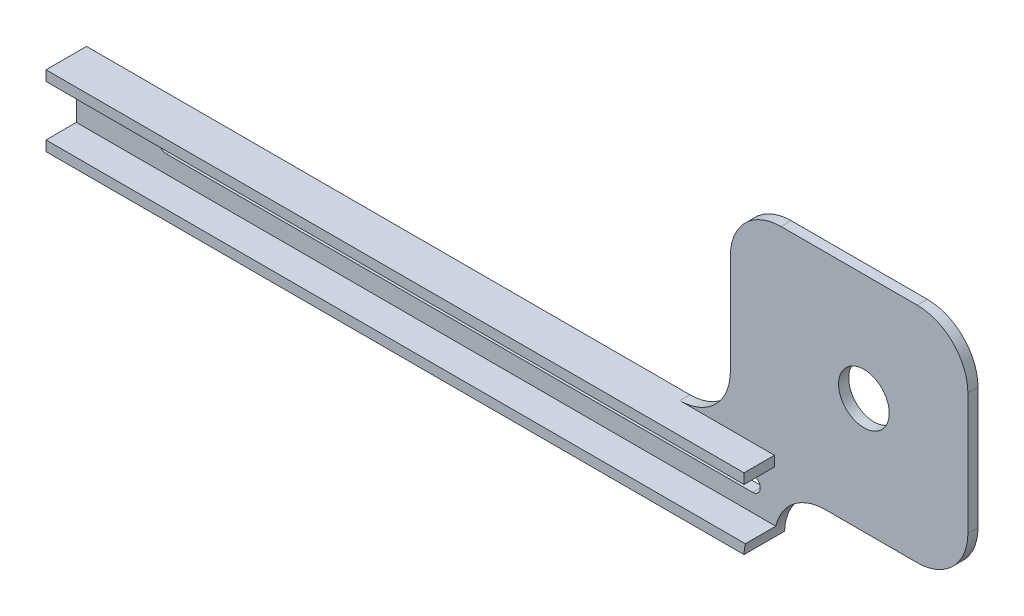
ISO-10303-21;
HEADER;
FILE_DESCRIPTION(('STEP AP214'),'2;1');
FILE_NAME('part.step','',(''),(''),'','','');
FILE_SCHEMA(('AUTOMOTIVE_DESIGN { 1 0 10303 214 1 1 1 1 }'));
ENDSEC;
DATA;
#1=APPLICATION_CONTEXT('core data for automotive mechanical design processes');
#2=APPLICATION_PROTOCOL_DEFINITION('international standard','automotive_design',2000,#1);
#3=PRODUCT_CONTEXT('',#1,'mechanical');
#4=PRODUCT('Part','Part','',(#3));
#5=PRODUCT_RELATED_PRODUCT_CATEGORY('part','',(#4));
#6=PRODUCT_DEFINITION_FORMATION('','',#4);
#7=PRODUCT_DEFINITION_CONTEXT('part definition',#1,'design');
#8=PRODUCT_DEFINITION('design','',#6,#7);
#9=PRODUCT_DEFINITION_SHAPE('','',#8);
#10=(LENGTH_UNIT() NAMED_UNIT(*) SI_UNIT(.MILLI.,.METRE.));
#11=(NAMED_UNIT(*) PLANE_ANGLE_UNIT() SI_UNIT($,.RADIAN.));
#12=(NAMED_UNIT(*) SI_UNIT($,.STERADIAN.) SOLID_ANGLE_UNIT());
#13=UNCERTAINTY_MEASURE_WITH_UNIT(LENGTH_MEASURE(1.E-05),#10,'distance_accuracy_value','');
#14=(GEOMETRIC_REPRESENTATION_CONTEXT(3) GLOBAL_UNCERTAINTY_ASSIGNED_CONTEXT((#13)) GLOBAL_UNIT_ASSIGNED_CONTEXT((#10,
#11,#12)) REPRESENTATION_CONTEXT('',''));
#15=CARTESIAN_POINT('',(0.,0.,0.));
#16=DIRECTION('',(0.,0.,1.));
#17=DIRECTION('',(1.,0.,0.));
#18=AXIS2_PLACEMENT_3D('',#15,#16,#17);
#19=CARTESIAN_POINT('',(0.,0.,-12.4577761138942));
#20=DIRECTION('',(0.,0.,1.));
#21=DIRECTION('',(1.,0.,0.));
#22=AXIS2_PLACEMENT_3D('',#19,#20,#21);
#23=PLANE('',#22);
#24=DIRECTION('',(1.,0.,0.));
#25=VECTOR('',#24,1.);
#26=CARTESIAN_POINT('',(0.,21.8576281221092,-12.4577761138942));
#27=LINE('',#26,#25);
#28=CARTESIAN_POINT('',(12.6949971843607,21.8576281221092,-12.4577761138942));
#29=VERTEX_POINT('',#28);
#30=CARTESIAN_POINT('',(35.8128892215013,21.8576281221092,-12.4577761138942));
#31=VERTEX_POINT('',#30);
#32=EDGE_CURVE('E216',#29,#31,#27,.T.);
#33=ORIENTED_EDGE('',*,*,#32,.T.);
#34=CARTESIAN_POINT('',(35.8128892215013,34.5576281221092,-12.4577761138942));
#35=DIRECTION('',(0.,0.,1.));
#36=DIRECTION('',(1.,0.,0.));
#37=AXIS2_PLACEMENT_3D('',#34,#35,#36);
#38=CIRCLE('',#37,12.7);
#39=CARTESIAN_POINT('',(48.5128892215013,34.5576281221092,-12.4577761138942));
#40=VERTEX_POINT('',#39);
#41=EDGE_CURVE('E258',#31,#40,#38,.T.);
#42=ORIENTED_EDGE('',*,*,#41,.T.);
#43=DIRECTION('',(0.,-1.,0.));
#44=VECTOR('',#43,1.);
#45=CARTESIAN_POINT('',(48.5128892215013,92.1462730990898,-12.4577761138942));
#46=LINE('',#45,#44);
#47=CARTESIAN_POINT('',(48.5128892215013,65.1027477203647,-12.4577761138942));
#48=VERTEX_POINT('',#47);
#49=EDGE_CURVE('E298',#48,#40,#46,.T.);
#50=ORIENTED_EDGE('',*,*,#49,.F.);
#51=CARTESIAN_POINT('',(35.8128892215013,65.1027477203647,-12.4577761138942));
#52=DIRECTION('',(0.,0.,1.));
#53=DIRECTION('',(1.,0.,0.));
#54=AXIS2_PLACEMENT_3D('',#51,#52,#53);
#55=CIRCLE('',#54,12.7);
#56=CARTESIAN_POINT('',(35.8128892215012,77.8027477203647,-12.4577761138942));
#57=VERTEX_POINT('',#56);
#58=EDGE_CURVE('E256',#48,#57,#55,.T.);
#59=ORIENTED_EDGE('',*,*,#58,.T.);
#60=DIRECTION('',(-1.,0.,0.));
#61=VECTOR('',#60,1.);
#62=CARTESIAN_POINT('',(-175.067056308692,77.8027477203647,-12.4577761138942));
#63=LINE('',#62,#61);
#64=CARTESIAN_POINT('',(1.64991922651991,77.8027477203647,-12.4577761138942));
#65=VERTEX_POINT('',#64);
#66=EDGE_CURVE('E210',#57,#65,#63,.T.);
#67=ORIENTED_EDGE('',*,*,#66,.T.);
#68=CARTESIAN_POINT('',(1.64991922651998,65.1027477203647,-12.4577761138942));
#69=DIRECTION('',(0.,0.,1.));
#70=DIRECTION('',(1.,0.,0.));
#71=AXIS2_PLACEMENT_3D('',#68,#69,#70);
#72=CIRCLE('',#71,12.7);
#73=CARTESIAN_POINT('',(-11.05008077348,65.1027477203647,-12.4577761138942));
#74=VERTEX_POINT('',#73);
#75=EDGE_CURVE('E254',#65,#74,#72,.T.);
#76=ORIENTED_EDGE('',*,*,#75,.T.);
#77=DIRECTION('',(0.,1.,0.));
#78=VECTOR('',#77,1.);
#79=CARTESIAN_POINT('',(-11.05008077348,27.2940639355094,-12.4577761138942));
#80=LINE('',#79,#78);
#81=CARTESIAN_POINT('',(-11.05008077348,39.9940639355094,-12.4577761138942));
#82=VERTEX_POINT('',#81);
#83=EDGE_CURVE('E202',#82,#74,#80,.T.);
#84=ORIENTED_EDGE('',*,*,#83,.F.);
#85=CARTESIAN_POINT('',(-23.75008077348,39.9940639355094,-12.4577761138942));
#86=DIRECTION('',(0.,0.,1.));
#87=DIRECTION('',(1.,0.,0.));
#88=AXIS2_PLACEMENT_3D('',#85,#86,#87);
#89=CIRCLE('',#88,12.7);
#90=CARTESIAN_POINT('',(-23.75008077348,27.2940639355094,-12.4577761138942));
#91=VERTEX_POINT('',#90);
#92=EDGE_CURVE('E264',#82,#91,#89,.F.);
#93=ORIENTED_EDGE('',*,*,#92,.T.);
#94=DIRECTION('',(-1.,0.,0.));
#95=VECTOR('',#94,1.);
#96=CARTESIAN_POINT('',(-175.067056308692,27.2940639355094,-12.4577761138942));
#97=LINE('',#96,#95);
#98=CARTESIAN_POINT('',(0.,27.2940639355094,-12.4577761138942));
#99=VERTEX_POINT('',#98);
#100=EDGE_CURVE('E314',#99,#91,#97,.T.);
#101=ORIENTED_EDGE('',*,*,#100,.F.);
#102=DIRECTION('',(0.,1.,0.));
#103=VECTOR('',#102,1.);
#104=CARTESIAN_POINT('',(0.,24.7540639355094,-12.4577761138942));
#105=LINE('',#104,#103);
#106=CARTESIAN_POINT('',(0.,24.7540639355094,-12.4577761138942));
#107=VERTEX_POINT('',#106);
#108=EDGE_CURVE('E321',#107,#99,#105,.T.);
#109=ORIENTED_EDGE('',*,*,#108,.F.);
#110=DIRECTION('',(1.,0.,0.));
#111=VECTOR('',#110,1.);
#112=CARTESIAN_POINT('',(-175.067056308692,24.7540639355094,-12.4577761138942));
#113=LINE('',#112,#111);
#114=CARTESIAN_POINT('',(-175.067056308692,24.7540639355094,-12.4577761138942));
#115=VERTEX_POINT('',#114);
#116=EDGE_CURVE('E311',#115,#107,#113,.T.);
#117=ORIENTED_EDGE('',*,*,#116,.F.);
#118=DIRECTION('',(0.,-1.,0.));
#119=VECTOR('',#118,1.);
#120=CARTESIAN_POINT('',(-175.067056308692,77.8027477203647,-12.4577761138942));
#121=LINE('',#120,#119);
#122=CARTESIAN_POINT('',(-175.067056308692,12.0540639355095,-12.4577761138942));
#123=VERTEX_POINT('',#122);
#124=EDGE_CURVE('E225',#115,#123,#121,.T.);
#125=ORIENTED_EDGE('',*,*,#124,.T.);
#126=DIRECTION('',(-1.,0.,0.));
#127=VECTOR('',#126,1.);
#128=CARTESIAN_POINT('',(-175.067056308692,12.0540639355095,-12.4577761138942));
#129=LINE('',#128,#127);
#130=CARTESIAN_POINT('',(0.329696558057507,12.0540639355094,-12.4577761138942));
#131=VERTEX_POINT('',#130);
#132=EDGE_CURVE('E52',#131,#123,#129,.T.);
#133=ORIENTED_EDGE('',*,*,#132,.F.);
#134=CARTESIAN_POINT('',(12.6949971843607,9.15762812210916,-12.4577761138942));
#135=DIRECTION('',(0.,0.,1.));
#136=DIRECTION('',(1.,0.,0.));
#137=AXIS2_PLACEMENT_3D('',#134,#135,#136);
#138=CIRCLE('',#137,12.7);
#139=EDGE_CURVE('E45',#131,#29,#138,.F.);
#140=ORIENTED_EDGE('',*,*,#139,.T.);
#141=EDGE_LOOP('',(#33,#42,#50,#59,#67,#76,#84,#93,#101,#109,#117,#125,#133,#140));
#142=FACE_BOUND('',#141,.T.);
#143=CARTESIAN_POINT('',(22.4397960445111,50.8255354857187,-12.4577761138942));
#144=DIRECTION('',(0.,0.,1.));
#145=DIRECTION('',(1.,0.,0.));
#146=AXIS2_PLACEMENT_3D('',#143,#144,#145);
#147=CIRCLE('',#146,6.35);
#148=CARTESIAN_POINT('',(28.7897960445111,50.8255354857187,-12.4577761138942));
#149=VERTEX_POINT('',#148);
#150=EDGE_CURVE('E333',#149,#149,#147,.T.);
#151=ORIENTED_EDGE('',*,*,#150,.F.);
#152=EDGE_LOOP('',(#151));
#153=FACE_BOUND('',#152,.T.);
#154=CARTESIAN_POINT('',(-152.479240822598,18.4040639355094,-12.4577761138942));
#155=DIRECTION('',(0.,0.,1.));
#156=DIRECTION('',(1.,0.,0.));
#157=AXIS2_PLACEMENT_3D('',#154,#155,#156);
#158=CIRCLE('',#157,1.905);
#159=CARTESIAN_POINT('',(-152.479240822598,20.3090639355095,-12.4577761138942));
#160=VERTEX_POINT('',#159);
#161=CARTESIAN_POINT('',(-152.479240822598,16.4990639355094,-12.4577761138942));
#162=VERTEX_POINT('',#161);
#163=EDGE_CURVE('E337',#160,#162,#158,.T.);
#164=ORIENTED_EDGE('',*,*,#163,.F.);
#165=DIRECTION('',(-1.,0.,0.));
#166=VECTOR('',#165,1.);
#167=CARTESIAN_POINT('',(-152.479240822598,20.3090639355095,-12.4577761138942));
#168=LINE('',#167,#166);
#169=CARTESIAN_POINT('',(-5.46440703052732,20.3090639355095,-12.4577761138942));
#170=VERTEX_POINT('',#169);
#171=EDGE_CURVE('E344',#170,#160,#168,.T.);
#172=ORIENTED_EDGE('',*,*,#171,.F.);
#173=CARTESIAN_POINT('',(-5.46440703052732,18.4040639355094,-12.4577761138942));
#174=DIRECTION('',(0.,0.,1.));
#175=DIRECTION('',(1.,0.,0.));
#176=AXIS2_PLACEMENT_3D('',#173,#174,#175);
#177=CIRCLE('',#176,1.905);
#178=CARTESIAN_POINT('',(-5.46440703052732,16.4990639355094,-12.4577761138942));
#179=VERTEX_POINT('',#178);
#180=EDGE_CURVE('E357',#179,#170,#177,.T.);
#181=ORIENTED_EDGE('',*,*,#180,.F.);
#182=DIRECTION('',(1.,0.,0.));
#183=VECTOR('',#182,1.);
#184=CARTESIAN_POINT('',(-152.479240822598,16.4990639355094,-12.4577761138942));
#185=LINE('',#184,#183);
#186=EDGE_CURVE('E354',#162,#179,#185,.T.);
#187=ORIENTED_EDGE('',*,*,#186,.F.);
#188=EDGE_LOOP('',(#164,#172,#181,#187));
#189=FACE_BOUND('',#188,.T.);
#190=ADVANCED_FACE('F37',(#142,#153,#189),#23,.T.);
#191=CARTESIAN_POINT('',(-175.067056308692,77.8027477203647,-14.9977761138942));
#192=DIRECTION('',(-1.,0.,0.));
#193=DIRECTION('',(0.,0.,1.));
#194=AXIS2_PLACEMENT_3D('',#191,#192,#193);
#195=PLANE('',#194);
#196=DIRECTION('',(0.,0.,-1.));
#197=VECTOR('',#196,1.);
#198=CARTESIAN_POINT('',(-175.067056308692,27.2940639355094,-4.83777611389422));
#199=LINE('',#198,#197);
#200=CARTESIAN_POINT('',(-175.067056308692,27.2940639355094,-4.83777611389422));
#201=VERTEX_POINT('',#200);
#202=CARTESIAN_POINT('',(-175.067056308692,27.2940639355094,-14.9977761138942));
#203=VERTEX_POINT('',#202);
#204=EDGE_CURVE('E180',#201,#203,#199,.T.);
#205=ORIENTED_EDGE('',*,*,#204,.T.);
#206=DIRECTION('',(0.,-1.,0.));
#207=VECTOR('',#206,1.);
#208=CARTESIAN_POINT('',(-175.067056308692,77.8027477203647,-14.9977761138942));
#209=LINE('',#208,#207);
#210=CARTESIAN_POINT('',(-175.067056308692,9.51406393550945,-14.9977761138942));
#211=VERTEX_POINT('',#210);
#212=EDGE_CURVE('E185',#203,#211,#209,.T.);
#213=ORIENTED_EDGE('',*,*,#212,.T.);
#214=DIRECTION('',(0.,0.,-1.));
#215=VECTOR('',#214,1.);
#216=CARTESIAN_POINT('',(-175.067056308692,9.51406393550945,-4.83777611389422));
#217=LINE('',#216,#215);
#218=CARTESIAN_POINT('',(-175.067056308692,9.51406393550945,-4.83777611389422));
#219=VERTEX_POINT('',#218);
#220=EDGE_CURVE('E290',#219,#211,#217,.T.);
#221=ORIENTED_EDGE('',*,*,#220,.F.);
#222=DIRECTION('',(0.,-1.,0.));
#223=VECTOR('',#222,1.);
#224=CARTESIAN_POINT('',(-175.067056308692,12.0540639355095,-4.83777611389422));
#225=LINE('',#224,#223);
#226=CARTESIAN_POINT('',(-175.067056308692,12.0540639355095,-4.83777611389422));
#227=VERTEX_POINT('',#226);
#228=EDGE_CURVE('E292',#227,#219,#225,.T.);
#229=ORIENTED_EDGE('',*,*,#228,.F.);
#230=DIRECTION('',(0.,0.,-1.));
#231=VECTOR('',#230,1.);
#232=CARTESIAN_POINT('',(-175.067056308692,12.0540639355095,-4.83777611389422));
#233=LINE('',#232,#231);
#234=EDGE_CURVE('E305',#227,#123,#233,.T.);
#235=ORIENTED_EDGE('',*,*,#234,.T.);
#236=ORIENTED_EDGE('',*,*,#124,.F.);
#237=DIRECTION('',(0.,0.,-1.));
#238=VECTOR('',#237,1.);
#239=CARTESIAN_POINT('',(-175.067056308692,24.7540639355094,-4.83777611389422));
#240=LINE('',#239,#238);
#241=CARTESIAN_POINT('',(-175.067056308692,24.7540639355094,-4.83777611389422));
#242=VERTEX_POINT('',#241);
#243=EDGE_CURVE('E330',#242,#115,#240,.T.);
#244=ORIENTED_EDGE('',*,*,#243,.F.);
#245=DIRECTION('',(0.,-1.,0.));
#246=VECTOR('',#245,1.);
#247=CARTESIAN_POINT('',(-175.067056308692,24.7540639355094,-4.83777611389422));
#248=LINE('',#247,#246);
#249=EDGE_CURVE('E188',#201,#242,#248,.T.);
#250=ORIENTED_EDGE('',*,*,#249,.F.);
#251=EDGE_LOOP('',(#205,#213,#221,#229,#235,#236,#244,#250));
#252=FACE_BOUND('',#251,.T.);
#253=ADVANCED_FACE('F182',(#252),#195,.T.);
#254=CARTESIAN_POINT('',(-175.067056308692,77.8027477203647,-14.9977761138942));
#255=DIRECTION('',(0.,1.,0.));
#256=DIRECTION('',(0.,0.,1.));
#257=AXIS2_PLACEMENT_3D('',#254,#255,#256);
#258=PLANE('',#257);
#259=ORIENTED_EDGE('',*,*,#66,.F.);
#260=DIRECTION('',(0.,0.,1.));
#261=VECTOR('',#260,1.);
#262=CARTESIAN_POINT('',(35.8128892215013,77.8027477203647,-14.9977761138942));
#263=LINE('',#262,#261);
#264=CARTESIAN_POINT('',(35.8128892215012,77.8027477203647,-14.9977761138942));
#265=VERTEX_POINT('',#264);
#266=EDGE_CURVE('E262',#57,#265,#263,.F.);
#267=ORIENTED_EDGE('',*,*,#266,.T.);
#268=DIRECTION('',(-1.,0.,0.));
#269=VECTOR('',#268,1.);
#270=CARTESIAN_POINT('',(-175.067056308692,77.8027477203647,-14.9977761138942));
#271=LINE('',#270,#269);
#272=CARTESIAN_POINT('',(1.64991922651991,77.8027477203647,-14.9977761138942));
#273=VERTEX_POINT('',#272);
#274=EDGE_CURVE('E213',#265,#273,#271,.T.);
#275=ORIENTED_EDGE('',*,*,#274,.T.);
#276=DIRECTION('',(0.,0.,-1.));
#277=VECTOR('',#276,1.);
#278=CARTESIAN_POINT('',(1.64991922651998,77.8027477203647,-12.4577761138942));
#279=LINE('',#278,#277);
#280=EDGE_CURVE('E260',#273,#65,#279,.F.);
#281=ORIENTED_EDGE('',*,*,#280,.T.);
#282=EDGE_LOOP('',(#259,#267,#275,#281));
#283=FACE_BOUND('',#282,.T.);
#284=ADVANCED_FACE('F401',(#283),#258,.T.);
#285=CARTESIAN_POINT('',(0.,21.8576281221092,-14.9977761138942));
#286=DIRECTION('',(0.,-1.,0.));
#287=DIRECTION('',(0.,0.,-1.));
#288=AXIS2_PLACEMENT_3D('',#285,#286,#287);
#289=PLANE('',#288);
#290=ORIENTED_EDGE('',*,*,#32,.F.);
#291=DIRECTION('',(0.,0.,-1.));
#292=VECTOR('',#291,1.);
#293=CARTESIAN_POINT('',(12.6949971843607,21.8576281221092,-14.9977761138942));
#294=LINE('',#293,#292);
#295=CARTESIAN_POINT('',(12.6949971843607,21.8576281221092,-14.9977761138942));
#296=VERTEX_POINT('',#295);
#297=EDGE_CURVE('E240',#29,#296,#294,.T.);
#298=ORIENTED_EDGE('',*,*,#297,.T.);
#299=DIRECTION('',(1.,0.,0.));
#300=VECTOR('',#299,1.);
#301=CARTESIAN_POINT('',(0.,21.8576281221092,-14.9977761138942));
#302=LINE('',#301,#300);
#303=CARTESIAN_POINT('',(35.8128892215013,21.8576281221092,-14.9977761138942));
#304=VERTEX_POINT('',#303);
#305=EDGE_CURVE('E209',#296,#304,#302,.T.);
#306=ORIENTED_EDGE('',*,*,#305,.T.);
#307=DIRECTION('',(0.,0.,-1.));
#308=VECTOR('',#307,1.);
#309=CARTESIAN_POINT('',(35.8128892215013,21.8576281221092,-12.4577761138942));
#310=LINE('',#309,#308);
#311=EDGE_CURVE('E238',#304,#31,#310,.F.);
#312=ORIENTED_EDGE('',*,*,#311,.T.);
#313=EDGE_LOOP('',(#290,#298,#306,#312));
#314=FACE_BOUND('',#313,.T.);
#315=ADVANCED_FACE('F280',(#314),#289,.T.);
#316=CARTESIAN_POINT('',(0.,0.,-14.9977761138942));
#317=DIRECTION('',(0.,0.,1.));
#318=DIRECTION('',(1.,0.,0.));
#319=AXIS2_PLACEMENT_3D('',#316,#317,#318);
#320=PLANE('',#319);
#321=CARTESIAN_POINT('',(22.4397960445111,50.8255354857187,-14.9977761138942));
#322=DIRECTION('',(0.,0.,1.));
#323=DIRECTION('',(1.,0.,0.));
#324=AXIS2_PLACEMENT_3D('',#321,#322,#323);
#325=CIRCLE('',#324,6.35);
#326=CARTESIAN_POINT('',(28.7897960445111,50.8255354857187,-14.9977761138942));
#327=VERTEX_POINT('',#326);
#328=EDGE_CURVE('E334',#327,#327,#325,.T.);
#329=ORIENTED_EDGE('',*,*,#328,.T.);
#330=EDGE_LOOP('',(#329));
#331=FACE_BOUND('',#330,.T.);
#332=DIRECTION('',(-1.,0.,0.));
#333=VECTOR('',#332,1.);
#334=CARTESIAN_POINT('',(-152.479240822598,20.3090639355095,-14.9977761138942));
#335=LINE('',#334,#333);
#336=CARTESIAN_POINT('',(-5.46440703052732,20.3090639355095,-14.9977761138942));
#337=VERTEX_POINT('',#336);
#338=CARTESIAN_POINT('',(-152.479240822598,20.3090639355095,-14.9977761138942));
#339=VERTEX_POINT('',#338);
#340=EDGE_CURVE('E350',#337,#339,#335,.T.);
#341=ORIENTED_EDGE('',*,*,#340,.T.);
#342=CARTESIAN_POINT('',(-152.479240822598,18.4040639355094,-14.9977761138942));
#343=DIRECTION('',(0.,0.,1.));
#344=DIRECTION('',(1.,0.,0.));
#345=AXIS2_PLACEMENT_3D('',#342,#343,#344);
#346=CIRCLE('',#345,1.905);
#347=CARTESIAN_POINT('',(-152.479240822598,16.4990639355094,-14.9977761138942));
#348=VERTEX_POINT('',#347);
#349=EDGE_CURVE('E340',#339,#348,#346,.T.);
#350=ORIENTED_EDGE('',*,*,#349,.T.);
#351=DIRECTION('',(1.,0.,0.));
#352=VECTOR('',#351,1.);
#353=CARTESIAN_POINT('',(-152.479240822598,16.4990639355094,-14.9977761138942));
#354=LINE('',#353,#352);
#355=CARTESIAN_POINT('',(-5.46440703052732,16.4990639355094,-14.9977761138942));
#356=VERTEX_POINT('',#355);
#357=EDGE_CURVE('E343',#348,#356,#354,.T.);
#358=ORIENTED_EDGE('',*,*,#357,.T.);
#359=CARTESIAN_POINT('',(-5.46440703052732,18.4040639355094,-14.9977761138942));
#360=DIRECTION('',(0.,0.,1.));
#361=DIRECTION('',(1.,0.,0.));
#362=AXIS2_PLACEMENT_3D('',#359,#360,#361);
#363=CIRCLE('',#362,1.905);
#364=EDGE_CURVE('E347',#356,#337,#363,.T.);
#365=ORIENTED_EDGE('',*,*,#364,.T.);
#366=EDGE_LOOP('',(#341,#350,#358,#365));
#367=FACE_BOUND('',#366,.T.);
#368=DIRECTION('',(0.,-1.,0.));
#369=VECTOR('',#368,1.);
#370=CARTESIAN_POINT('',(48.5128892215013,0.,-14.9977761138942));
#371=LINE('',#370,#369);
#372=CARTESIAN_POINT('',(48.5128892215013,65.1027477203647,-14.9977761138942));
#373=VERTEX_POINT('',#372);
#374=CARTESIAN_POINT('',(48.5128892215013,34.5576281221092,-14.9977761138942));
#375=VERTEX_POINT('',#374);
#376=EDGE_CURVE('E224',#373,#375,#371,.T.);
#377=ORIENTED_EDGE('',*,*,#376,.T.);
#378=CARTESIAN_POINT('',(35.8128892215013,34.5576281221092,-14.9977761138942));
#379=DIRECTION('',(0.,0.,1.));
#380=DIRECTION('',(1.,0.,0.));
#381=AXIS2_PLACEMENT_3D('',#378,#379,#380);
#382=CIRCLE('',#381,12.7);
#383=EDGE_CURVE('E252',#375,#304,#382,.F.);
#384=ORIENTED_EDGE('',*,*,#383,.T.);
#385=ORIENTED_EDGE('',*,*,#305,.F.);
#386=CARTESIAN_POINT('',(12.6949971843607,9.15762812210916,-14.9977761138942));
#387=DIRECTION('',(0.,0.,1.));
#388=DIRECTION('',(1.,0.,0.));
#389=AXIS2_PLACEMENT_3D('',#386,#387,#388);
#390=CIRCLE('',#389,12.7);
#391=CARTESIAN_POINT('',(0.,9.51406393550945,-14.9977761138942));
#392=VERTEX_POINT('',#391);
#393=EDGE_CURVE('E11',#296,#392,#390,.T.);
#394=ORIENTED_EDGE('',*,*,#393,.T.);
#395=DIRECTION('',(-1.,0.,0.));
#396=VECTOR('',#395,1.);
#397=CARTESIAN_POINT('',(-175.067056308692,9.51406393550945,-14.9977761138942));
#398=LINE('',#397,#396);
#399=EDGE_CURVE('E208',#392,#211,#398,.T.);
#400=ORIENTED_EDGE('',*,*,#399,.T.);
#401=ORIENTED_EDGE('',*,*,#212,.F.);
#402=DIRECTION('',(1.,0.,0.));
#403=VECTOR('',#402,1.);
#404=CARTESIAN_POINT('',(-175.067056308692,27.2940639355094,-14.9977761138942));
#405=LINE('',#404,#403);
#406=CARTESIAN_POINT('',(-23.75008077348,27.2940639355094,-14.9977761138942));
#407=VERTEX_POINT('',#406);
#408=EDGE_CURVE('E195',#203,#407,#405,.T.);
#409=ORIENTED_EDGE('',*,*,#408,.T.);
#410=CARTESIAN_POINT('',(-23.75008077348,39.9940639355094,-14.9977761138942));
#411=DIRECTION('',(0.,0.,1.));
#412=DIRECTION('',(1.,0.,0.));
#413=AXIS2_PLACEMENT_3D('',#410,#411,#412);
#414=CIRCLE('',#413,12.7);
#415=CARTESIAN_POINT('',(-11.05008077348,39.9940639355094,-14.9977761138942));
#416=VERTEX_POINT('',#415);
#417=EDGE_CURVE('E267',#407,#416,#414,.T.);
#418=ORIENTED_EDGE('',*,*,#417,.T.);
#419=DIRECTION('',(0.,1.,0.));
#420=VECTOR('',#419,1.);
#421=CARTESIAN_POINT('',(-11.05008077348,27.2940639355094,-14.9977761138942));
#422=LINE('',#421,#420);
#423=CARTESIAN_POINT('',(-11.05008077348,65.1027477203647,-14.9977761138942));
#424=VERTEX_POINT('',#423);
#425=EDGE_CURVE('E201',#416,#424,#422,.T.);
#426=ORIENTED_EDGE('',*,*,#425,.T.);
#427=CARTESIAN_POINT('',(1.64991922651998,65.1027477203647,-14.9977761138942));
#428=DIRECTION('',(0.,0.,1.));
#429=DIRECTION('',(1.,0.,0.));
#430=AXIS2_PLACEMENT_3D('',#427,#428,#429);
#431=CIRCLE('',#430,12.7);
#432=EDGE_CURVE('E248',#424,#273,#431,.F.);
#433=ORIENTED_EDGE('',*,*,#432,.T.);
#434=ORIENTED_EDGE('',*,*,#274,.F.);
#435=CARTESIAN_POINT('',(35.8128892215013,65.1027477203647,-14.9977761138942));
#436=DIRECTION('',(0.,0.,1.));
#437=DIRECTION('',(1.,0.,0.));
#438=AXIS2_PLACEMENT_3D('',#435,#436,#437);
#439=CIRCLE('',#438,12.7);
#440=EDGE_CURVE('E250',#265,#373,#439,.F.);
#441=ORIENTED_EDGE('',*,*,#440,.T.);
#442=EDGE_LOOP('',(#377,#384,#385,#394,#400,#401,#409,#418,#426,#433,#434,#441));
#443=FACE_BOUND('',#442,.T.);
#444=ADVANCED_FACE('F206',(#331,#367,#443),#320,.F.);
#445=CARTESIAN_POINT('',(-152.479240822598,18.4040639355094,-14.9977761138942));
#446=DIRECTION('',(0.,0.,1.));
#447=DIRECTION('',(1.,0.,0.));
#448=AXIS2_PLACEMENT_3D('',#445,#446,#447);
#449=CYLINDRICAL_SURFACE('',#448,1.905);
#450=ORIENTED_EDGE('',*,*,#163,.T.);
#451=DIRECTION('',(0.,0.,1.));
#452=VECTOR('',#451,1.);
#453=CARTESIAN_POINT('',(-152.479240822598,16.4990639355094,-14.9977761138942));
#454=LINE('',#453,#452);
#455=EDGE_CURVE('E219',#348,#162,#454,.T.);
#456=ORIENTED_EDGE('',*,*,#455,.F.);
#457=ORIENTED_EDGE('',*,*,#349,.F.);
#458=DIRECTION('',(0.,0.,1.));
#459=VECTOR('',#458,1.);
#460=CARTESIAN_POINT('',(-152.479240822598,20.3090639355095,-14.9977761138942));
#461=LINE('',#460,#459);
#462=EDGE_CURVE('E227',#339,#160,#461,.T.);
#463=ORIENTED_EDGE('',*,*,#462,.T.);
#464=EDGE_LOOP('',(#450,#456,#457,#463));
#465=FACE_BOUND('',#464,.T.);
#466=ADVANCED_FACE('F383',(#465),#449,.F.);
#467=CARTESIAN_POINT('',(-152.479240822598,20.3090639355095,-14.9977761138942));
#468=DIRECTION('',(0.,1.,0.));
#469=DIRECTION('',(0.,0.,1.));
#470=AXIS2_PLACEMENT_3D('',#467,#468,#469);
#471=PLANE('',#470);
#472=ORIENTED_EDGE('',*,*,#171,.T.);
#473=ORIENTED_EDGE('',*,*,#462,.F.);
#474=ORIENTED_EDGE('',*,*,#340,.F.);
#475=DIRECTION('',(0.,0.,1.));
#476=VECTOR('',#475,1.);
#477=CARTESIAN_POINT('',(-5.46440703052732,20.3090639355095,-14.9977761138942));
#478=LINE('',#477,#476);
#479=EDGE_CURVE('E363',#337,#170,#478,.T.);
#480=ORIENTED_EDGE('',*,*,#479,.T.);
#481=EDGE_LOOP('',(#472,#473,#474,#480));
#482=FACE_BOUND('',#481,.T.);
#483=ADVANCED_FACE('F381',(#482),#471,.F.);
#484=CARTESIAN_POINT('',(-5.46440703052732,18.4040639355094,-14.9977761138942));
#485=DIRECTION('',(0.,0.,1.));
#486=DIRECTION('',(1.,0.,0.));
#487=AXIS2_PLACEMENT_3D('',#484,#485,#486);
#488=CYLINDRICAL_SURFACE('',#487,1.905);
#489=ORIENTED_EDGE('',*,*,#180,.T.);
#490=ORIENTED_EDGE('',*,*,#479,.F.);
#491=ORIENTED_EDGE('',*,*,#364,.F.);
#492=DIRECTION('',(0.,0.,1.));
#493=VECTOR('',#492,1.);
#494=CARTESIAN_POINT('',(-5.46440703052732,16.4990639355094,-14.9977761138942));
#495=LINE('',#494,#493);
#496=EDGE_CURVE('E364',#356,#179,#495,.T.);
#497=ORIENTED_EDGE('',*,*,#496,.T.);
#498=EDGE_LOOP('',(#489,#490,#491,#497));
#499=FACE_BOUND('',#498,.T.);
#500=ADVANCED_FACE('F378',(#499),#488,.F.);
#501=CARTESIAN_POINT('',(-152.479240822598,16.4990639355094,-14.9977761138942));
#502=DIRECTION('',(0.,-1.,0.));
#503=DIRECTION('',(0.,0.,-1.));
#504=AXIS2_PLACEMENT_3D('',#501,#502,#503);
#505=PLANE('',#504);
#506=ORIENTED_EDGE('',*,*,#186,.T.);
#507=ORIENTED_EDGE('',*,*,#496,.F.);
#508=ORIENTED_EDGE('',*,*,#357,.F.);
#509=ORIENTED_EDGE('',*,*,#455,.T.);
#510=EDGE_LOOP('',(#506,#507,#508,#509));
#511=FACE_BOUND('',#510,.T.);
#512=ADVANCED_FACE('F371',(#511),#505,.F.);
#513=CARTESIAN_POINT('',(22.4397960445111,50.8255354857187,-14.9977761138942));
#514=DIRECTION('',(0.,0.,1.));
#515=DIRECTION('',(1.,0.,0.));
#516=AXIS2_PLACEMENT_3D('',#513,#514,#515);
#517=CYLINDRICAL_SURFACE('',#516,6.35);
#518=ORIENTED_EDGE('',*,*,#328,.F.);
#519=EDGE_LOOP('',(#518));
#520=FACE_BOUND('',#519,.T.);
#521=ORIENTED_EDGE('',*,*,#150,.T.);
#522=EDGE_LOOP('',(#521));
#523=FACE_BOUND('',#522,.T.);
#524=ADVANCED_FACE('F479',(#520,#523),#517,.F.);
#525=CARTESIAN_POINT('',(-175.067056308692,24.7540639355094,-4.83777611389422));
#526=DIRECTION('',(0.,1.,0.));
#527=DIRECTION('',(0.,0.,1.));
#528=AXIS2_PLACEMENT_3D('',#525,#526,#527);
#529=PLANE('',#528);
#530=ORIENTED_EDGE('',*,*,#116,.T.);
#531=DIRECTION('',(0.,0.,-1.));
#532=VECTOR('',#531,1.);
#533=CARTESIAN_POINT('',(0.,24.7540639355094,-4.83777611389422));
#534=LINE('',#533,#532);
#535=CARTESIAN_POINT('',(0.,24.7540639355094,-4.83777611389422));
#536=VERTEX_POINT('',#535);
#537=EDGE_CURVE('E327',#536,#107,#534,.T.);
#538=ORIENTED_EDGE('',*,*,#537,.F.);
#539=DIRECTION('',(1.,0.,0.));
#540=VECTOR('',#539,1.);
#541=CARTESIAN_POINT('',(-175.067056308692,24.7540639355094,-4.83777611389422));
#542=LINE('',#541,#540);
#543=EDGE_CURVE('E313',#242,#536,#542,.T.);
#544=ORIENTED_EDGE('',*,*,#543,.F.);
#545=ORIENTED_EDGE('',*,*,#243,.T.);
#546=EDGE_LOOP('',(#530,#538,#544,#545));
#547=FACE_BOUND('',#546,.T.);
#548=ADVANCED_FACE('F452',(#547),#529,.F.);
#549=CARTESIAN_POINT('',(0.,24.7540639355094,-4.83777611389422));
#550=DIRECTION('',(-1.,0.,0.));
#551=DIRECTION('',(0.,0.,1.));
#552=AXIS2_PLACEMENT_3D('',#549,#550,#551);
#553=PLANE('',#552);
#554=ORIENTED_EDGE('',*,*,#108,.T.);
#555=DIRECTION('',(0.,0.,-1.));
#556=VECTOR('',#555,1.);
#557=CARTESIAN_POINT('',(0.,27.2940639355094,-4.83777611389422));
#558=LINE('',#557,#556);
#559=CARTESIAN_POINT('',(0.,27.2940639355094,-4.83777611389422));
#560=VERTEX_POINT('',#559);
#561=EDGE_CURVE('E191',#560,#99,#558,.T.);
#562=ORIENTED_EDGE('',*,*,#561,.F.);
#563=DIRECTION('',(0.,1.,0.));
#564=VECTOR('',#563,1.);
#565=CARTESIAN_POINT('',(0.,24.7540639355094,-4.83777611389422));
#566=LINE('',#565,#564);
#567=EDGE_CURVE('E316',#536,#560,#566,.T.);
#568=ORIENTED_EDGE('',*,*,#567,.F.);
#569=ORIENTED_EDGE('',*,*,#537,.T.);
#570=EDGE_LOOP('',(#554,#562,#568,#569));
#571=FACE_BOUND('',#570,.T.);
#572=ADVANCED_FACE('F446',(#571),#553,.F.);
#573=CARTESIAN_POINT('',(-175.067056308692,27.2940639355094,-4.83777611389422));
#574=DIRECTION('',(0.,-1.,0.));
#575=DIRECTION('',(0.,0.,-1.));
#576=AXIS2_PLACEMENT_3D('',#573,#574,#575);
#577=PLANE('',#576);
#578=ORIENTED_EDGE('',*,*,#100,.T.);
#579=DIRECTION('',(0.,0.,1.));
#580=VECTOR('',#579,1.);
#581=CARTESIAN_POINT('',(-23.75008077348,27.2940639355094,-14.9977761138942));
#582=LINE('',#581,#580);
#583=EDGE_CURVE('E198',#91,#407,#582,.F.);
#584=ORIENTED_EDGE('',*,*,#583,.T.);
#585=ORIENTED_EDGE('',*,*,#408,.F.);
#586=ORIENTED_EDGE('',*,*,#204,.F.);
#587=DIRECTION('',(-1.,0.,0.));
#588=VECTOR('',#587,1.);
#589=CARTESIAN_POINT('',(-175.067056308692,27.2940639355094,-4.83777611389422));
#590=LINE('',#589,#588);
#591=EDGE_CURVE('E192',#560,#201,#590,.T.);
#592=ORIENTED_EDGE('',*,*,#591,.F.);
#593=ORIENTED_EDGE('',*,*,#561,.T.);
#594=EDGE_LOOP('',(#578,#584,#585,#586,#592,#593));
#595=FACE_BOUND('',#594,.T.);
#596=ADVANCED_FACE('F196',(#595),#577,.F.);
#597=CARTESIAN_POINT('',(0.,0.,-4.83777611389422));
#598=DIRECTION('',(0.,0.,-1.));
#599=DIRECTION('',(-1.,0.,0.));
#600=AXIS2_PLACEMENT_3D('',#597,#598,#599);
#601=PLANE('',#600);
#602=ORIENTED_EDGE('',*,*,#249,.T.);
#603=ORIENTED_EDGE('',*,*,#543,.T.);
#604=ORIENTED_EDGE('',*,*,#567,.T.);
#605=ORIENTED_EDGE('',*,*,#591,.T.);
#606=EDGE_LOOP('',(#602,#603,#604,#605));
#607=FACE_BOUND('',#606,.T.);
#608=ADVANCED_FACE('F450',(#607),#601,.F.);
#609=CARTESIAN_POINT('',(-175.067056308692,9.51406393550945,-4.83777611389422));
#610=DIRECTION('',(0.,1.,0.));
#611=DIRECTION('',(0.,0.,1.));
#612=AXIS2_PLACEMENT_3D('',#609,#610,#611);
#613=PLANE('',#612);
#614=ORIENTED_EDGE('',*,*,#220,.T.);
#615=ORIENTED_EDGE('',*,*,#399,.F.);
#616=DIRECTION('',(0.,0.,-1.));
#617=VECTOR('',#616,1.);
#618=CARTESIAN_POINT('',(0.,9.51406393550945,-4.83777611389422));
#619=LINE('',#618,#617);
#620=CARTESIAN_POINT('',(0.,9.51406393550945,-4.83777611389422));
#621=VERTEX_POINT('',#620);
#622=EDGE_CURVE('E287',#621,#392,#619,.T.);
#623=ORIENTED_EDGE('',*,*,#622,.F.);
#624=DIRECTION('',(1.,0.,0.));
#625=VECTOR('',#624,1.);
#626=CARTESIAN_POINT('',(-175.067056308692,9.51406393550945,-4.83777611389422));
#627=LINE('',#626,#625);
#628=EDGE_CURVE('E302',#219,#621,#627,.T.);
#629=ORIENTED_EDGE('',*,*,#628,.F.);
#630=EDGE_LOOP('',(#614,#615,#623,#629));
#631=FACE_BOUND('',#630,.T.);
#632=ADVANCED_FACE('F289',(#631),#613,.F.);
#633=CARTESIAN_POINT('',(-175.067056308692,12.0540639355095,-4.83777611389422));
#634=DIRECTION('',(0.,-1.,0.));
#635=DIRECTION('',(1.,0.,0.));
#636=AXIS2_PLACEMENT_3D('',#633,#634,#635);
#637=PLANE('',#636);
#638=ORIENTED_EDGE('',*,*,#132,.T.);
#639=ORIENTED_EDGE('',*,*,#234,.F.);
#640=DIRECTION('',(-1.,0.,0.));
#641=VECTOR('',#640,1.);
#642=CARTESIAN_POINT('',(-175.067056308692,12.0540639355095,-4.83777611389422));
#643=LINE('',#642,#641);
#644=CARTESIAN_POINT('',(0.329696558057507,12.0540639355094,-4.83777611389422));
#645=VERTEX_POINT('',#644);
#646=EDGE_CURVE('E59',#645,#227,#643,.T.);
#647=ORIENTED_EDGE('',*,*,#646,.F.);
#648=DIRECTION('',(0.,0.,1.));
#649=VECTOR('',#648,1.);
#650=CARTESIAN_POINT('',(0.329696558057557,12.0540639355094,-4.83777611389422));
#651=LINE('',#650,#649);
#652=EDGE_CURVE('E271',#645,#131,#651,.F.);
#653=ORIENTED_EDGE('',*,*,#652,.T.);
#654=EDGE_LOOP('',(#638,#639,#647,#653));
#655=FACE_BOUND('',#654,.T.);
#656=ADVANCED_FACE('F455',(#655),#637,.F.);
#657=CARTESIAN_POINT('',(0.,0.,-4.83777611389422));
#658=DIRECTION('',(0.,0.,1.));
#659=DIRECTION('',(1.,0.,0.));
#660=AXIS2_PLACEMENT_3D('',#657,#658,#659);
#661=PLANE('',#660);
#662=ORIENTED_EDGE('',*,*,#228,.T.);
#663=ORIENTED_EDGE('',*,*,#628,.T.);
#664=CARTESIAN_POINT('',(12.6949971843607,9.15762812210916,-4.83777611389422));
#665=DIRECTION('',(0.,0.,1.));
#666=DIRECTION('',(1.,0.,0.));
#667=AXIS2_PLACEMENT_3D('',#664,#665,#666);
#668=CIRCLE('',#667,12.7);
#669=EDGE_CURVE('E269',#621,#645,#668,.F.);
#670=ORIENTED_EDGE('',*,*,#669,.T.);
#671=ORIENTED_EDGE('',*,*,#646,.T.);
#672=EDGE_LOOP('',(#662,#663,#670,#671));
#673=FACE_BOUND('',#672,.T.);
#674=ADVANCED_FACE('F457',(#673),#661,.T.);
#675=CARTESIAN_POINT('',(-11.05008077348,27.2940639355094,-14.9977761138942));
#676=DIRECTION('',(1.,0.,0.));
#677=DIRECTION('',(0.,0.,-1.));
#678=AXIS2_PLACEMENT_3D('',#675,#676,#677);
#679=PLANE('',#678);
#680=ORIENTED_EDGE('',*,*,#425,.F.);
#681=DIRECTION('',(0.,0.,1.));
#682=VECTOR('',#681,1.);
#683=CARTESIAN_POINT('',(-11.05008077348,39.9940639355094,-12.4577761138942));
#684=LINE('',#683,#682);
#685=EDGE_CURVE('E234',#416,#82,#684,.T.);
#686=ORIENTED_EDGE('',*,*,#685,.T.);
#687=ORIENTED_EDGE('',*,*,#83,.T.);
#688=DIRECTION('',(0.,0.,-1.));
#689=VECTOR('',#688,1.);
#690=CARTESIAN_POINT('',(-11.05008077348,65.1027477203647,-14.9977761138942));
#691=LINE('',#690,#689);
#692=EDGE_CURVE('E231',#74,#424,#691,.T.);
#693=ORIENTED_EDGE('',*,*,#692,.T.);
#694=EDGE_LOOP('',(#680,#686,#687,#693));
#695=FACE_BOUND('',#694,.T.);
#696=ADVANCED_FACE('F440',(#695),#679,.F.);
#697=CARTESIAN_POINT('',(48.5128892215013,92.1462730990898,-14.9977761138942));
#698=DIRECTION('',(-1.,0.,0.));
#699=DIRECTION('',(0.,0.,1.));
#700=AXIS2_PLACEMENT_3D('',#697,#698,#699);
#701=PLANE('',#700);
#702=ORIENTED_EDGE('',*,*,#49,.T.);
#703=DIRECTION('',(0.,0.,-1.));
#704=VECTOR('',#703,1.);
#705=CARTESIAN_POINT('',(48.5128892215013,34.5576281221092,-14.9977761138942));
#706=LINE('',#705,#704);
#707=EDGE_CURVE('E245',#40,#375,#706,.T.);
#708=ORIENTED_EDGE('',*,*,#707,.T.);
#709=ORIENTED_EDGE('',*,*,#376,.F.);
#710=DIRECTION('',(0.,0.,1.));
#711=VECTOR('',#710,1.);
#712=CARTESIAN_POINT('',(48.5128892215013,65.1027477203647,-12.4577761138942));
#713=LINE('',#712,#711);
#714=EDGE_CURVE('E242',#373,#48,#713,.T.);
#715=ORIENTED_EDGE('',*,*,#714,.T.);
#716=EDGE_LOOP('',(#702,#708,#709,#715));
#717=FACE_BOUND('',#716,.T.);
#718=ADVANCED_FACE('F411',(#717),#701,.F.);
#719=CARTESIAN_POINT('',(-23.75008077348,39.9940639355094,-14.9977761138942));
#720=DIRECTION('',(0.,0.,-1.));
#721=DIRECTION('',(-1.,0.,0.));
#722=AXIS2_PLACEMENT_3D('',#719,#720,#721);
#723=CYLINDRICAL_SURFACE('',#722,12.7);
#724=ORIENTED_EDGE('',*,*,#417,.F.);
#725=ORIENTED_EDGE('',*,*,#583,.F.);
#726=ORIENTED_EDGE('',*,*,#92,.F.);
#727=ORIENTED_EDGE('',*,*,#685,.F.);
#728=EDGE_LOOP('',(#724,#725,#726,#727));
#729=FACE_BOUND('',#728,.T.);
#730=ADVANCED_FACE('F408',(#729),#723,.F.);
#731=CARTESIAN_POINT('',(12.6949971843607,9.15762812210916,-14.9977761138942));
#732=DIRECTION('',(0.,0.,1.));
#733=DIRECTION('',(1.,0.,0.));
#734=AXIS2_PLACEMENT_3D('',#731,#732,#733);
#735=CYLINDRICAL_SURFACE('',#734,12.7);
#736=ORIENTED_EDGE('',*,*,#393,.F.);
#737=ORIENTED_EDGE('',*,*,#297,.F.);
#738=ORIENTED_EDGE('',*,*,#139,.F.);
#739=ORIENTED_EDGE('',*,*,#652,.F.);
#740=ORIENTED_EDGE('',*,*,#669,.F.);
#741=ORIENTED_EDGE('',*,*,#622,.T.);
#742=EDGE_LOOP('',(#736,#737,#738,#739,#740,#741));
#743=FACE_BOUND('',#742,.T.);
#744=ADVANCED_FACE('F284',(#743),#735,.F.);
#745=CARTESIAN_POINT('',(35.8128892215013,34.5576281221092,-14.9977761138942));
#746=DIRECTION('',(0.,0.,1.));
#747=DIRECTION('',(1.,0.,0.));
#748=AXIS2_PLACEMENT_3D('',#745,#746,#747);
#749=CYLINDRICAL_SURFACE('',#748,12.7);
#750=ORIENTED_EDGE('',*,*,#41,.F.);
#751=ORIENTED_EDGE('',*,*,#311,.F.);
#752=ORIENTED_EDGE('',*,*,#383,.F.);
#753=ORIENTED_EDGE('',*,*,#707,.F.);
#754=EDGE_LOOP('',(#750,#751,#752,#753));
#755=FACE_BOUND('',#754,.T.);
#756=ADVANCED_FACE('F415',(#755),#749,.T.);
#757=CARTESIAN_POINT('',(35.8128892215013,65.1027477203647,-14.9977761138942));
#758=DIRECTION('',(0.,0.,-1.));
#759=DIRECTION('',(-1.,0.,0.));
#760=AXIS2_PLACEMENT_3D('',#757,#758,#759);
#761=CYLINDRICAL_SURFACE('',#760,12.7);
#762=ORIENTED_EDGE('',*,*,#440,.F.);
#763=ORIENTED_EDGE('',*,*,#266,.F.);
#764=ORIENTED_EDGE('',*,*,#58,.F.);
#765=ORIENTED_EDGE('',*,*,#714,.F.);
#766=EDGE_LOOP('',(#762,#763,#764,#765));
#767=FACE_BOUND('',#766,.T.);
#768=ADVANCED_FACE('F417',(#767),#761,.T.);
#769=CARTESIAN_POINT('',(1.64991922651998,65.1027477203647,-14.9977761138942));
#770=DIRECTION('',(0.,0.,1.));
#771=DIRECTION('',(1.,0.,0.));
#772=AXIS2_PLACEMENT_3D('',#769,#770,#771);
#773=CYLINDRICAL_SURFACE('',#772,12.7);
#774=ORIENTED_EDGE('',*,*,#75,.F.);
#775=ORIENTED_EDGE('',*,*,#280,.F.);
#776=ORIENTED_EDGE('',*,*,#432,.F.);
#777=ORIENTED_EDGE('',*,*,#692,.F.);
#778=EDGE_LOOP('',(#774,#775,#776,#777));
#779=FACE_BOUND('',#778,.T.);
#780=ADVANCED_FACE('F39',(#779),#773,.T.);
#781=CLOSED_SHELL('',(#190,#253,#284,#315,#444,#466,#483,#500,#512,#524,#548,#572,#596,#608,
#632,#656,#674,#696,#718,#730,#744,#756,#768,#780));
#782=MANIFOLD_SOLID_BREP('B2',#781);
#783=ADVANCED_BREP_SHAPE_REPRESENTATION('',(#18,#782),#14);
#784=SHAPE_DEFINITION_REPRESENTATION(#9,#783);
ENDSEC;
END-ISO-10303-21;
